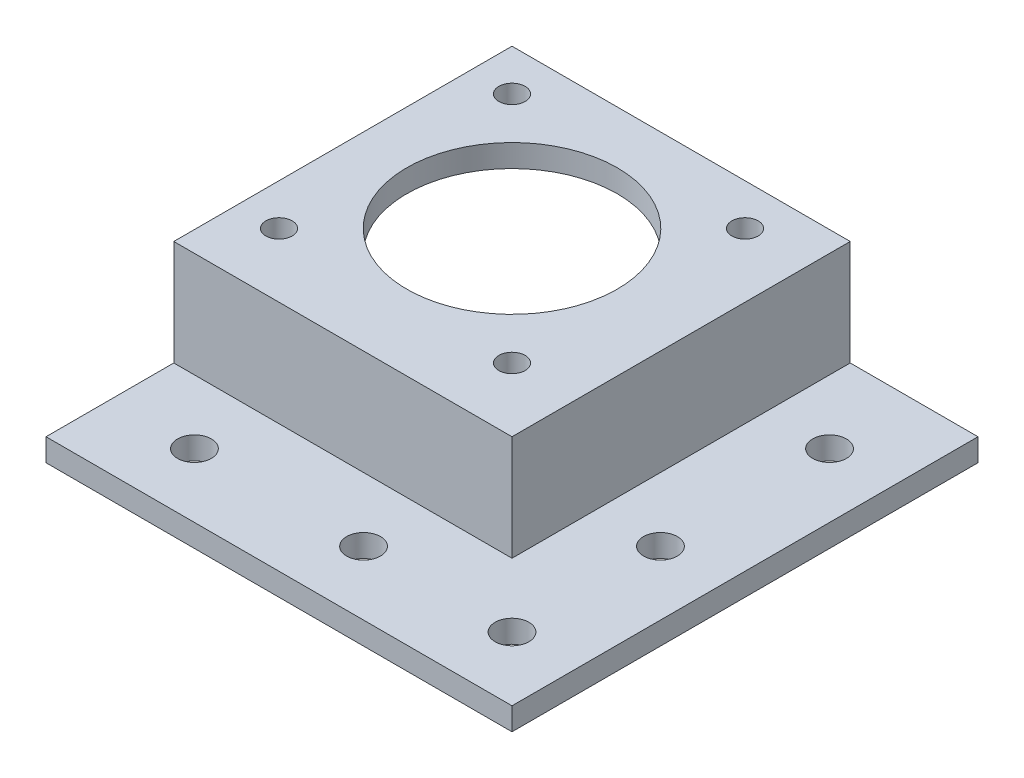
ISO-10303-21;
HEADER;
FILE_DESCRIPTION(('STEP AP214'),'2;1');
FILE_NAME('part.step','',(''),(''),'','','');
FILE_SCHEMA(('AUTOMOTIVE_DESIGN { 1 0 10303 214 1 1 1 1 }'));
ENDSEC;
DATA;
#1=APPLICATION_CONTEXT('core data for automotive mechanical design processes');
#2=APPLICATION_PROTOCOL_DEFINITION('international standard','automotive_design',2000,#1);
#3=PRODUCT_CONTEXT('',#1,'mechanical');
#4=PRODUCT('Part','Part','',(#3));
#5=PRODUCT_RELATED_PRODUCT_CATEGORY('part','',(#4));
#6=PRODUCT_DEFINITION_FORMATION('','',#4);
#7=PRODUCT_DEFINITION_CONTEXT('part definition',#1,'design');
#8=PRODUCT_DEFINITION('design','',#6,#7);
#9=PRODUCT_DEFINITION_SHAPE('','',#8);
#10=(LENGTH_UNIT() NAMED_UNIT(*) SI_UNIT(.MILLI.,.METRE.));
#11=(NAMED_UNIT(*) PLANE_ANGLE_UNIT() SI_UNIT($,.RADIAN.));
#12=(NAMED_UNIT(*) SI_UNIT($,.STERADIAN.) SOLID_ANGLE_UNIT());
#13=UNCERTAINTY_MEASURE_WITH_UNIT(LENGTH_MEASURE(1.E-05),#10,'distance_accuracy_value','');
#14=(GEOMETRIC_REPRESENTATION_CONTEXT(3) GLOBAL_UNCERTAINTY_ASSIGNED_CONTEXT((#13)) GLOBAL_UNIT_ASSIGNED_CONTEXT((#10,
#11,#12)) REPRESENTATION_CONTEXT('',''));
#15=CARTESIAN_POINT('',(0.,0.,0.));
#16=DIRECTION('',(0.,0.,1.));
#17=DIRECTION('',(1.,0.,0.));
#18=AXIS2_PLACEMENT_3D('',#15,#16,#17);
#19=CARTESIAN_POINT('',(0.,0.,42.));
#20=DIRECTION('',(0.,-1.,0.));
#21=DIRECTION('',(0.,0.,-1.));
#22=AXIS2_PLACEMENT_3D('',#19,#20,#21);
#23=PLANE('',#22);
#24=CARTESIAN_POINT('',(36.5,0.,36.5));
#25=DIRECTION('',(0.,-1.,0.));
#26=DIRECTION('',(0.,0.,1.));
#27=AXIS2_PLACEMENT_3D('',#24,#25,#26);
#28=CIRCLE('',#27,1.75);
#29=CARTESIAN_POINT('',(36.5,0.,38.25));
#30=VERTEX_POINT('',#29);
#31=EDGE_CURVE('E211',#30,#30,#28,.T.);
#32=ORIENTED_EDGE('',*,*,#31,.T.);
#33=EDGE_LOOP('',(#32));
#34=FACE_BOUND('',#33,.T.);
#35=CARTESIAN_POINT('',(36.5,0.,5.5));
#36=DIRECTION('',(0.,-1.,0.));
#37=DIRECTION('',(0.,0.,-1.));
#38=AXIS2_PLACEMENT_3D('',#35,#36,#37);
#39=CIRCLE('',#38,1.75);
#40=CARTESIAN_POINT('',(36.5,0.,3.75));
#41=VERTEX_POINT('',#40);
#42=EDGE_CURVE('E215',#41,#41,#39,.T.);
#43=ORIENTED_EDGE('',*,*,#42,.T.);
#44=EDGE_LOOP('',(#43));
#45=FACE_BOUND('',#44,.T.);
#46=CARTESIAN_POINT('',(21.,0.,21.));
#47=DIRECTION('',(0.,-1.,0.));
#48=DIRECTION('',(0.,0.,-1.));
#49=AXIS2_PLACEMENT_3D('',#46,#47,#48);
#50=CIRCLE('',#49,14.);
#51=CARTESIAN_POINT('',(21.,0.,7.));
#52=VERTEX_POINT('',#51);
#53=EDGE_CURVE('E219',#52,#52,#50,.T.);
#54=ORIENTED_EDGE('',*,*,#53,.T.);
#55=EDGE_LOOP('',(#54));
#56=FACE_BOUND('',#55,.T.);
#57=CARTESIAN_POINT('',(5.5,0.,5.5));
#58=DIRECTION('',(0.,-1.,0.));
#59=DIRECTION('',(0.,0.,1.));
#60=AXIS2_PLACEMENT_3D('',#57,#58,#59);
#61=CIRCLE('',#60,1.75);
#62=CARTESIAN_POINT('',(5.5,0.,7.25));
#63=VERTEX_POINT('',#62);
#64=EDGE_CURVE('E223',#63,#63,#61,.T.);
#65=ORIENTED_EDGE('',*,*,#64,.T.);
#66=EDGE_LOOP('',(#65));
#67=FACE_BOUND('',#66,.T.);
#68=CARTESIAN_POINT('',(5.5,0.,36.5));
#69=DIRECTION('',(0.,-1.,0.));
#70=DIRECTION('',(0.,0.,-1.));
#71=AXIS2_PLACEMENT_3D('',#68,#69,#70);
#72=CIRCLE('',#71,1.75);
#73=CARTESIAN_POINT('',(5.5,0.,34.75));
#74=VERTEX_POINT('',#73);
#75=EDGE_CURVE('E226',#74,#74,#72,.T.);
#76=ORIENTED_EDGE('',*,*,#75,.T.);
#77=EDGE_LOOP('',(#76));
#78=FACE_BOUND('',#77,.T.);
#79=DIRECTION('',(-1.,0.,0.));
#80=VECTOR('',#79,1.);
#81=CARTESIAN_POINT('',(0.,0.,0.));
#82=LINE('',#81,#80);
#83=CARTESIAN_POINT('',(45.,0.,0.));
#84=VERTEX_POINT('',#83);
#85=CARTESIAN_POINT('',(0.,0.,0.));
#86=VERTEX_POINT('',#85);
#87=EDGE_CURVE('E106',#84,#86,#82,.T.);
#88=ORIENTED_EDGE('',*,*,#87,.T.);
#89=DIRECTION('',(0.,0.,-1.));
#90=VECTOR('',#89,1.);
#91=CARTESIAN_POINT('',(0.,0.,42.));
#92=LINE('',#91,#90);
#93=CARTESIAN_POINT('',(0.,0.,45.));
#94=VERTEX_POINT('',#93);
#95=EDGE_CURVE('E41',#94,#86,#92,.T.);
#96=ORIENTED_EDGE('',*,*,#95,.F.);
#97=DIRECTION('',(-1.,0.,0.));
#98=VECTOR('',#97,1.);
#99=CARTESIAN_POINT('',(0.,0.,45.));
#100=LINE('',#99,#98);
#101=CARTESIAN_POINT('',(45.,0.,45.));
#102=VERTEX_POINT('',#101);
#103=EDGE_CURVE('E108',#102,#94,#100,.T.);
#104=ORIENTED_EDGE('',*,*,#103,.F.);
#105=DIRECTION('',(0.,0.,-1.));
#106=VECTOR('',#105,1.);
#107=CARTESIAN_POINT('',(45.,0.,42.));
#108=LINE('',#107,#106);
#109=EDGE_CURVE('E95',#102,#84,#108,.T.);
#110=ORIENTED_EDGE('',*,*,#109,.T.);
#111=EDGE_LOOP('',(#88,#96,#104,#110));
#112=FACE_BOUND('',#111,.T.);
#113=ADVANCED_FACE('F38',(#34,#45,#56,#67,#78,#112),#23,.F.);
#114=CARTESIAN_POINT('',(0.,0.,42.));
#115=DIRECTION('',(1.,0.,0.));
#116=DIRECTION('',(0.,0.,-1.));
#117=AXIS2_PLACEMENT_3D('',#114,#115,#116);
#118=PLANE('',#117);
#119=DIRECTION('',(0.,-1.,0.));
#120=VECTOR('',#119,1.);
#121=CARTESIAN_POINT('',(0.,0.,0.));
#122=LINE('',#121,#120);
#123=CARTESIAN_POINT('',(0.,-3.,0.));
#124=VERTEX_POINT('',#123);
#125=EDGE_CURVE('E113',#86,#124,#122,.T.);
#126=ORIENTED_EDGE('',*,*,#125,.T.);
#127=DIRECTION('',(0.,0.,-1.));
#128=VECTOR('',#127,1.);
#129=CARTESIAN_POINT('',(0.,-3.,42.));
#130=LINE('',#129,#128);
#131=CARTESIAN_POINT('',(0.,-3.,42.));
#132=VERTEX_POINT('',#131);
#133=EDGE_CURVE('E142',#132,#124,#130,.T.);
#134=ORIENTED_EDGE('',*,*,#133,.F.);
#135=DIRECTION('',(0.,1.,0.));
#136=VECTOR('',#135,1.);
#137=CARTESIAN_POINT('',(0.,0.,42.));
#138=LINE('',#137,#136);
#139=CARTESIAN_POINT('',(0.,-17.,42.));
#140=VERTEX_POINT('',#139);
#141=EDGE_CURVE('E158',#140,#132,#138,.T.);
#142=ORIENTED_EDGE('',*,*,#141,.F.);
#143=DIRECTION('',(0.,0.,-1.));
#144=VECTOR('',#143,1.);
#145=CARTESIAN_POINT('',(0.,-17.,45.));
#146=LINE('',#145,#144);
#147=CARTESIAN_POINT('',(0.,-17.,62.));
#148=VERTEX_POINT('',#147);
#149=EDGE_CURVE('E115',#148,#140,#146,.T.);
#150=ORIENTED_EDGE('',*,*,#149,.F.);
#151=DIRECTION('',(0.,-1.,0.));
#152=VECTOR('',#151,1.);
#153=CARTESIAN_POINT('',(0.,-17.,62.));
#154=LINE('',#153,#152);
#155=CARTESIAN_POINT('',(0.,-14.,62.));
#156=VERTEX_POINT('',#155);
#157=EDGE_CURVE('E228',#156,#148,#154,.T.);
#158=ORIENTED_EDGE('',*,*,#157,.F.);
#159=DIRECTION('',(0.,0.,-1.));
#160=VECTOR('',#159,1.);
#161=CARTESIAN_POINT('',(0.,-14.,62.));
#162=LINE('',#161,#160);
#163=CARTESIAN_POINT('',(0.,-14.,45.));
#164=VERTEX_POINT('',#163);
#165=EDGE_CURVE('E165',#156,#164,#162,.T.);
#166=ORIENTED_EDGE('',*,*,#165,.T.);
#167=DIRECTION('',(0.,1.,0.));
#168=VECTOR('',#167,1.);
#169=CARTESIAN_POINT('',(0.,0.,45.));
#170=LINE('',#169,#168);
#171=EDGE_CURVE('E120',#164,#94,#170,.T.);
#172=ORIENTED_EDGE('',*,*,#171,.T.);
#173=ORIENTED_EDGE('',*,*,#95,.T.);
#174=EDGE_LOOP('',(#126,#134,#142,#150,#158,#166,#172,#173));
#175=FACE_BOUND('',#174,.T.);
#176=ADVANCED_FACE('F146',(#175),#118,.F.);
#177=CARTESIAN_POINT('',(0.,-3.,42.));
#178=DIRECTION('',(0.,1.,0.));
#179=DIRECTION('',(0.,0.,1.));
#180=AXIS2_PLACEMENT_3D('',#177,#178,#179);
#181=PLANE('',#180);
#182=CARTESIAN_POINT('',(36.5,-3.,36.5));
#183=DIRECTION('',(0.,-1.,0.));
#184=DIRECTION('',(0.,0.,1.));
#185=AXIS2_PLACEMENT_3D('',#182,#183,#184);
#186=CIRCLE('',#185,1.75);
#187=CARTESIAN_POINT('',(36.5,-3.,38.25));
#188=VERTEX_POINT('',#187);
#189=EDGE_CURVE('E233',#188,#188,#186,.T.);
#190=ORIENTED_EDGE('',*,*,#189,.F.);
#191=EDGE_LOOP('',(#190));
#192=FACE_BOUND('',#191,.T.);
#193=CARTESIAN_POINT('',(36.5,-3.,5.5));
#194=DIRECTION('',(0.,-1.,0.));
#195=DIRECTION('',(0.,0.,-1.));
#196=AXIS2_PLACEMENT_3D('',#193,#194,#195);
#197=CIRCLE('',#196,1.75);
#198=CARTESIAN_POINT('',(36.5,-3.,3.75));
#199=VERTEX_POINT('',#198);
#200=EDGE_CURVE('E371',#199,#199,#197,.T.);
#201=ORIENTED_EDGE('',*,*,#200,.F.);
#202=EDGE_LOOP('',(#201));
#203=FACE_BOUND('',#202,.T.);
#204=CARTESIAN_POINT('',(21.,-3.,21.));
#205=DIRECTION('',(0.,-1.,0.));
#206=DIRECTION('',(0.,0.,-1.));
#207=AXIS2_PLACEMENT_3D('',#204,#205,#206);
#208=CIRCLE('',#207,14.);
#209=CARTESIAN_POINT('',(21.,-3.,7.));
#210=VERTEX_POINT('',#209);
#211=EDGE_CURVE('E361',#210,#210,#208,.T.);
#212=ORIENTED_EDGE('',*,*,#211,.F.);
#213=EDGE_LOOP('',(#212));
#214=FACE_BOUND('',#213,.T.);
#215=CARTESIAN_POINT('',(5.5,-3.,5.5));
#216=DIRECTION('',(0.,-1.,0.));
#217=DIRECTION('',(0.,0.,1.));
#218=AXIS2_PLACEMENT_3D('',#215,#216,#217);
#219=CIRCLE('',#218,1.75);
#220=CARTESIAN_POINT('',(5.5,-3.,7.25));
#221=VERTEX_POINT('',#220);
#222=EDGE_CURVE('E365',#221,#221,#219,.T.);
#223=ORIENTED_EDGE('',*,*,#222,.F.);
#224=EDGE_LOOP('',(#223));
#225=FACE_BOUND('',#224,.T.);
#226=CARTESIAN_POINT('',(5.5,-3.,36.5));
#227=DIRECTION('',(0.,-1.,0.));
#228=DIRECTION('',(0.,0.,-1.));
#229=AXIS2_PLACEMENT_3D('',#226,#227,#228);
#230=CIRCLE('',#229,1.75);
#231=CARTESIAN_POINT('',(5.5,-3.,34.75));
#232=VERTEX_POINT('',#231);
#233=EDGE_CURVE('E229',#232,#232,#230,.T.);
#234=ORIENTED_EDGE('',*,*,#233,.F.);
#235=EDGE_LOOP('',(#234));
#236=FACE_BOUND('',#235,.T.);
#237=DIRECTION('',(1.,0.,0.));
#238=VECTOR('',#237,1.);
#239=CARTESIAN_POINT('',(0.,-3.,0.));
#240=LINE('',#239,#238);
#241=CARTESIAN_POINT('',(42.,-3.,0.));
#242=VERTEX_POINT('',#241);
#243=EDGE_CURVE('E117',#124,#242,#240,.T.);
#244=ORIENTED_EDGE('',*,*,#243,.T.);
#245=DIRECTION('',(0.,0.,-1.));
#246=VECTOR('',#245,1.);
#247=CARTESIAN_POINT('',(42.,-3.,42.));
#248=LINE('',#247,#246);
#249=CARTESIAN_POINT('',(42.,-3.,42.));
#250=VERTEX_POINT('',#249);
#251=EDGE_CURVE('E55',#250,#242,#248,.T.);
#252=ORIENTED_EDGE('',*,*,#251,.F.);
#253=DIRECTION('',(1.,0.,0.));
#254=VECTOR('',#253,1.);
#255=CARTESIAN_POINT('',(0.,-3.,42.));
#256=LINE('',#255,#254);
#257=EDGE_CURVE('E100',#132,#250,#256,.T.);
#258=ORIENTED_EDGE('',*,*,#257,.F.);
#259=ORIENTED_EDGE('',*,*,#133,.T.);
#260=EDGE_LOOP('',(#244,#252,#258,#259));
#261=FACE_BOUND('',#260,.T.);
#262=ADVANCED_FACE('F190',(#192,#203,#214,#225,#236,#261),#181,.F.);
#263=CARTESIAN_POINT('',(42.,-3.,42.));
#264=DIRECTION('',(1.,0.,0.));
#265=DIRECTION('',(0.,0.,-1.));
#266=AXIS2_PLACEMENT_3D('',#263,#264,#265);
#267=PLANE('',#266);
#268=DIRECTION('',(0.,-1.,0.));
#269=VECTOR('',#268,1.);
#270=CARTESIAN_POINT('',(42.,-3.,0.));
#271=LINE('',#270,#269);
#272=CARTESIAN_POINT('',(42.,-17.,0.));
#273=VERTEX_POINT('',#272);
#274=EDGE_CURVE('E126',#242,#273,#271,.T.);
#275=ORIENTED_EDGE('',*,*,#274,.T.);
#276=DIRECTION('',(0.,0.,-1.));
#277=VECTOR('',#276,1.);
#278=CARTESIAN_POINT('',(42.,-17.,42.));
#279=LINE('',#278,#277);
#280=CARTESIAN_POINT('',(42.,-17.,42.));
#281=VERTEX_POINT('',#280);
#282=EDGE_CURVE('E139',#281,#273,#279,.T.);
#283=ORIENTED_EDGE('',*,*,#282,.F.);
#284=DIRECTION('',(0.,-1.,0.));
#285=VECTOR('',#284,1.);
#286=CARTESIAN_POINT('',(42.,-3.,42.));
#287=LINE('',#286,#285);
#288=EDGE_CURVE('E109',#250,#281,#287,.T.);
#289=ORIENTED_EDGE('',*,*,#288,.F.);
#290=ORIENTED_EDGE('',*,*,#251,.T.);
#291=EDGE_LOOP('',(#275,#283,#289,#290));
#292=FACE_BOUND('',#291,.T.);
#293=ADVANCED_FACE('F192',(#292),#267,.F.);
#294=CARTESIAN_POINT('',(42.,-17.,42.));
#295=DIRECTION('',(0.,1.,0.));
#296=DIRECTION('',(0.,0.,1.));
#297=AXIS2_PLACEMENT_3D('',#294,#295,#296);
#298=PLANE('',#297);
#299=CARTESIAN_POINT('',(11.25,-17.,53.5));
#300=DIRECTION('',(0.,1.,0.));
#301=DIRECTION('',(0.,0.,1.));
#302=AXIS2_PLACEMENT_3D('',#299,#300,#301);
#303=CIRCLE('',#302,2.25);
#304=CARTESIAN_POINT('',(11.25,-17.,55.75));
#305=VERTEX_POINT('',#304);
#306=EDGE_CURVE('E330',#305,#305,#303,.T.);
#307=ORIENTED_EDGE('',*,*,#306,.T.);
#308=EDGE_LOOP('',(#307));
#309=FACE_BOUND('',#308,.T.);
#310=CARTESIAN_POINT('',(53.5,-17.,53.5));
#311=DIRECTION('',(0.,1.,0.));
#312=DIRECTION('',(0.,0.,1.));
#313=AXIS2_PLACEMENT_3D('',#310,#311,#312);
#314=CIRCLE('',#313,2.25);
#315=CARTESIAN_POINT('',(53.5,-17.,55.75));
#316=VERTEX_POINT('',#315);
#317=EDGE_CURVE('E338',#316,#316,#314,.T.);
#318=ORIENTED_EDGE('',*,*,#317,.T.);
#319=EDGE_LOOP('',(#318));
#320=FACE_BOUND('',#319,.T.);
#321=CARTESIAN_POINT('',(33.75,-17.,53.5));
#322=DIRECTION('',(0.,1.,0.));
#323=DIRECTION('',(0.,0.,-1.));
#324=AXIS2_PLACEMENT_3D('',#321,#322,#323);
#325=CIRCLE('',#324,2.25);
#326=CARTESIAN_POINT('',(33.75,-17.,51.25));
#327=VERTEX_POINT('',#326);
#328=EDGE_CURVE('E346',#327,#327,#325,.T.);
#329=ORIENTED_EDGE('',*,*,#328,.T.);
#330=EDGE_LOOP('',(#329));
#331=FACE_BOUND('',#330,.T.);
#332=CARTESIAN_POINT('',(53.5,-17.,11.25));
#333=DIRECTION('',(0.,1.,0.));
#334=DIRECTION('',(0.,0.,-1.));
#335=AXIS2_PLACEMENT_3D('',#332,#333,#334);
#336=CIRCLE('',#335,2.25000000000001);
#337=CARTESIAN_POINT('',(53.5,-17.,9.));
#338=VERTEX_POINT('',#337);
#339=EDGE_CURVE('E352',#338,#338,#336,.T.);
#340=ORIENTED_EDGE('',*,*,#339,.T.);
#341=EDGE_LOOP('',(#340));
#342=FACE_BOUND('',#341,.T.);
#343=CARTESIAN_POINT('',(53.5,-17.,33.75));
#344=DIRECTION('',(0.,1.,0.));
#345=DIRECTION('',(0.,0.,1.));
#346=AXIS2_PLACEMENT_3D('',#343,#344,#345);
#347=CIRCLE('',#346,2.25);
#348=CARTESIAN_POINT('',(53.5,-17.,36.));
#349=VERTEX_POINT('',#348);
#350=EDGE_CURVE('E358',#349,#349,#347,.T.);
#351=ORIENTED_EDGE('',*,*,#350,.T.);
#352=EDGE_LOOP('',(#351));
#353=FACE_BOUND('',#352,.T.);
#354=DIRECTION('',(1.,0.,0.));
#355=VECTOR('',#354,1.);
#356=CARTESIAN_POINT('',(42.,-17.,0.));
#357=LINE('',#356,#355);
#358=CARTESIAN_POINT('',(62.,-17.,0.));
#359=VERTEX_POINT('',#358);
#360=EDGE_CURVE('E128',#273,#359,#357,.T.);
#361=ORIENTED_EDGE('',*,*,#360,.T.);
#362=DIRECTION('',(0.,0.,-1.));
#363=VECTOR('',#362,1.);
#364=CARTESIAN_POINT('',(62.,-17.,42.));
#365=LINE('',#364,#363);
#366=CARTESIAN_POINT('',(62.,-17.,62.));
#367=VERTEX_POINT('',#366);
#368=EDGE_CURVE('E136',#367,#359,#365,.T.);
#369=ORIENTED_EDGE('',*,*,#368,.F.);
#370=DIRECTION('',(1.,0.,0.));
#371=VECTOR('',#370,1.);
#372=CARTESIAN_POINT('',(0.,-17.,62.));
#373=LINE('',#372,#371);
#374=EDGE_CURVE('E184',#148,#367,#373,.T.);
#375=ORIENTED_EDGE('',*,*,#374,.F.);
#376=ORIENTED_EDGE('',*,*,#149,.T.);
#377=DIRECTION('',(-1.,0.,0.));
#378=VECTOR('',#377,1.);
#379=CARTESIAN_POINT('',(0.,-17.,42.));
#380=LINE('',#379,#378);
#381=EDGE_CURVE('E162',#281,#140,#380,.T.);
#382=ORIENTED_EDGE('',*,*,#381,.F.);
#383=ORIENTED_EDGE('',*,*,#282,.T.);
#384=EDGE_LOOP('',(#361,#369,#375,#376,#382,#383));
#385=FACE_BOUND('',#384,.T.);
#386=ADVANCED_FACE('F176',(#309,#320,#331,#342,#353,#385),#298,.F.);
#387=CARTESIAN_POINT('',(62.,-17.,42.));
#388=DIRECTION('',(-1.,0.,0.));
#389=DIRECTION('',(0.,0.,1.));
#390=AXIS2_PLACEMENT_3D('',#387,#388,#389);
#391=PLANE('',#390);
#392=DIRECTION('',(0.,1.,0.));
#393=VECTOR('',#392,1.);
#394=CARTESIAN_POINT('',(62.,-17.,0.));
#395=LINE('',#394,#393);
#396=CARTESIAN_POINT('',(62.,-14.,0.));
#397=VERTEX_POINT('',#396);
#398=EDGE_CURVE('E130',#359,#397,#395,.T.);
#399=ORIENTED_EDGE('',*,*,#398,.T.);
#400=DIRECTION('',(0.,0.,-1.));
#401=VECTOR('',#400,1.);
#402=CARTESIAN_POINT('',(62.,-14.,42.));
#403=LINE('',#402,#401);
#404=CARTESIAN_POINT('',(62.,-14.,62.));
#405=VERTEX_POINT('',#404);
#406=EDGE_CURVE('E134',#405,#397,#403,.T.);
#407=ORIENTED_EDGE('',*,*,#406,.F.);
#408=DIRECTION('',(0.,1.,0.));
#409=VECTOR('',#408,1.);
#410=CARTESIAN_POINT('',(62.,-17.,62.));
#411=LINE('',#410,#409);
#412=EDGE_CURVE('E239',#367,#405,#411,.T.);
#413=ORIENTED_EDGE('',*,*,#412,.F.);
#414=ORIENTED_EDGE('',*,*,#368,.T.);
#415=EDGE_LOOP('',(#399,#407,#413,#414));
#416=FACE_BOUND('',#415,.T.);
#417=ADVANCED_FACE('F262',(#416),#391,.F.);
#418=CARTESIAN_POINT('',(45.,-14.,42.));
#419=DIRECTION('',(0.,-1.,0.));
#420=DIRECTION('',(0.,0.,-1.));
#421=AXIS2_PLACEMENT_3D('',#418,#419,#420);
#422=PLANE('',#421);
#423=CARTESIAN_POINT('',(11.25,-14.,53.5));
#424=DIRECTION('',(0.,1.,0.));
#425=DIRECTION('',(0.,0.,1.));
#426=AXIS2_PLACEMENT_3D('',#423,#424,#425);
#427=CIRCLE('',#426,2.25);
#428=CARTESIAN_POINT('',(11.25,-14.,55.75));
#429=VERTEX_POINT('',#428);
#430=EDGE_CURVE('E333',#429,#429,#427,.T.);
#431=ORIENTED_EDGE('',*,*,#430,.F.);
#432=EDGE_LOOP('',(#431));
#433=FACE_BOUND('',#432,.T.);
#434=CARTESIAN_POINT('',(53.5,-14.,53.5));
#435=DIRECTION('',(0.,1.,0.));
#436=DIRECTION('',(0.,0.,1.));
#437=AXIS2_PLACEMENT_3D('',#434,#435,#436);
#438=CIRCLE('',#437,2.25);
#439=CARTESIAN_POINT('',(53.5,-14.,55.75));
#440=VERTEX_POINT('',#439);
#441=EDGE_CURVE('E334',#440,#440,#438,.T.);
#442=ORIENTED_EDGE('',*,*,#441,.F.);
#443=EDGE_LOOP('',(#442));
#444=FACE_BOUND('',#443,.T.);
#445=CARTESIAN_POINT('',(33.75,-14.,53.5));
#446=DIRECTION('',(0.,1.,0.));
#447=DIRECTION('',(0.,0.,-1.));
#448=AXIS2_PLACEMENT_3D('',#445,#446,#447);
#449=CIRCLE('',#448,2.25);
#450=CARTESIAN_POINT('',(33.75,-14.,51.25));
#451=VERTEX_POINT('',#450);
#452=EDGE_CURVE('E343',#451,#451,#449,.T.);
#453=ORIENTED_EDGE('',*,*,#452,.F.);
#454=EDGE_LOOP('',(#453));
#455=FACE_BOUND('',#454,.T.);
#456=CARTESIAN_POINT('',(53.5,-14.,11.25));
#457=DIRECTION('',(0.,1.,0.));
#458=DIRECTION('',(0.,0.,-1.));
#459=AXIS2_PLACEMENT_3D('',#456,#457,#458);
#460=CIRCLE('',#459,2.25000000000001);
#461=CARTESIAN_POINT('',(53.5,-14.,9.));
#462=VERTEX_POINT('',#461);
#463=EDGE_CURVE('E349',#462,#462,#460,.T.);
#464=ORIENTED_EDGE('',*,*,#463,.F.);
#465=EDGE_LOOP('',(#464));
#466=FACE_BOUND('',#465,.T.);
#467=CARTESIAN_POINT('',(53.5,-14.,33.75));
#468=DIRECTION('',(0.,1.,0.));
#469=DIRECTION('',(0.,0.,1.));
#470=AXIS2_PLACEMENT_3D('',#467,#468,#469);
#471=CIRCLE('',#470,2.25);
#472=CARTESIAN_POINT('',(53.5,-14.,36.));
#473=VERTEX_POINT('',#472);
#474=EDGE_CURVE('E355',#473,#473,#471,.T.);
#475=ORIENTED_EDGE('',*,*,#474,.F.);
#476=EDGE_LOOP('',(#475));
#477=FACE_BOUND('',#476,.T.);
#478=DIRECTION('',(-1.,0.,0.));
#479=VECTOR('',#478,1.);
#480=CARTESIAN_POINT('',(45.,-14.,0.));
#481=LINE('',#480,#479);
#482=CARTESIAN_POINT('',(45.,-14.,0.));
#483=VERTEX_POINT('',#482);
#484=EDGE_CURVE('E84',#397,#483,#481,.T.);
#485=ORIENTED_EDGE('',*,*,#484,.T.);
#486=DIRECTION('',(0.,0.,-1.));
#487=VECTOR('',#486,1.);
#488=CARTESIAN_POINT('',(45.,-14.,42.));
#489=LINE('',#488,#487);
#490=CARTESIAN_POINT('',(45.,-14.,45.));
#491=VERTEX_POINT('',#490);
#492=EDGE_CURVE('E97',#491,#483,#489,.T.);
#493=ORIENTED_EDGE('',*,*,#492,.F.);
#494=DIRECTION('',(-1.,0.,0.));
#495=VECTOR('',#494,1.);
#496=CARTESIAN_POINT('',(0.,-14.,45.));
#497=LINE('',#496,#495);
#498=EDGE_CURVE('E11',#491,#164,#497,.T.);
#499=ORIENTED_EDGE('',*,*,#498,.T.);
#500=ORIENTED_EDGE('',*,*,#165,.F.);
#501=DIRECTION('',(-1.,0.,0.));
#502=VECTOR('',#501,1.);
#503=CARTESIAN_POINT('',(0.,-14.,62.));
#504=LINE('',#503,#502);
#505=EDGE_CURVE('E242',#405,#156,#504,.T.);
#506=ORIENTED_EDGE('',*,*,#505,.F.);
#507=ORIENTED_EDGE('',*,*,#406,.T.);
#508=EDGE_LOOP('',(#485,#493,#499,#500,#506,#507));
#509=FACE_BOUND('',#508,.T.);
#510=ADVANCED_FACE('F247',(#433,#444,#455,#466,#477,#509),#422,.F.);
#511=CARTESIAN_POINT('',(45.,0.,42.));
#512=DIRECTION('',(-1.,0.,0.));
#513=DIRECTION('',(0.,-1.,0.));
#514=AXIS2_PLACEMENT_3D('',#511,#512,#513);
#515=PLANE('',#514);
#516=DIRECTION('',(0.,1.,0.));
#517=VECTOR('',#516,1.);
#518=CARTESIAN_POINT('',(45.,0.,0.));
#519=LINE('',#518,#517);
#520=EDGE_CURVE('E90',#483,#84,#519,.T.);
#521=ORIENTED_EDGE('',*,*,#520,.T.);
#522=ORIENTED_EDGE('',*,*,#109,.F.);
#523=DIRECTION('',(0.,1.,0.));
#524=VECTOR('',#523,1.);
#525=CARTESIAN_POINT('',(45.,0.,45.));
#526=LINE('',#525,#524);
#527=EDGE_CURVE('E155',#491,#102,#526,.T.);
#528=ORIENTED_EDGE('',*,*,#527,.F.);
#529=ORIENTED_EDGE('',*,*,#492,.T.);
#530=EDGE_LOOP('',(#521,#522,#528,#529));
#531=FACE_BOUND('',#530,.T.);
#532=ADVANCED_FACE('F92',(#531),#515,.F.);
#533=CARTESIAN_POINT('',(0.,0.,0.));
#534=DIRECTION('',(0.,0.,-1.));
#535=DIRECTION('',(-1.,0.,0.));
#536=AXIS2_PLACEMENT_3D('',#533,#534,#535);
#537=PLANE('',#536);
#538=ORIENTED_EDGE('',*,*,#87,.F.);
#539=ORIENTED_EDGE('',*,*,#520,.F.);
#540=ORIENTED_EDGE('',*,*,#484,.F.);
#541=ORIENTED_EDGE('',*,*,#398,.F.);
#542=ORIENTED_EDGE('',*,*,#360,.F.);
#543=ORIENTED_EDGE('',*,*,#274,.F.);
#544=ORIENTED_EDGE('',*,*,#243,.F.);
#545=ORIENTED_EDGE('',*,*,#125,.F.);
#546=EDGE_LOOP('',(#538,#539,#540,#541,#542,#543,#544,#545));
#547=FACE_BOUND('',#546,.T.);
#548=ADVANCED_FACE('F111',(#547),#537,.T.);
#549=CARTESIAN_POINT('',(0.,0.,42.));
#550=DIRECTION('',(0.,0.,1.));
#551=DIRECTION('',(1.,0.,0.));
#552=AXIS2_PLACEMENT_3D('',#549,#550,#551);
#553=PLANE('',#552);
#554=ORIENTED_EDGE('',*,*,#141,.T.);
#555=ORIENTED_EDGE('',*,*,#257,.T.);
#556=ORIENTED_EDGE('',*,*,#288,.T.);
#557=ORIENTED_EDGE('',*,*,#381,.T.);
#558=EDGE_LOOP('',(#554,#555,#556,#557));
#559=FACE_BOUND('',#558,.T.);
#560=ADVANCED_FACE('F171',(#559),#553,.F.);
#561=CARTESIAN_POINT('',(0.,0.,45.));
#562=DIRECTION('',(0.,0.,1.));
#563=DIRECTION('',(1.,0.,0.));
#564=AXIS2_PLACEMENT_3D('',#561,#562,#563);
#565=PLANE('',#564);
#566=ORIENTED_EDGE('',*,*,#498,.F.);
#567=ORIENTED_EDGE('',*,*,#527,.T.);
#568=ORIENTED_EDGE('',*,*,#103,.T.);
#569=ORIENTED_EDGE('',*,*,#171,.F.);
#570=EDGE_LOOP('',(#566,#567,#568,#569));
#571=FACE_BOUND('',#570,.T.);
#572=ADVANCED_FACE('F153',(#571),#565,.T.);
#573=CARTESIAN_POINT('',(0.,0.,62.));
#574=DIRECTION('',(0.,0.,-1.));
#575=DIRECTION('',(-1.,0.,0.));
#576=AXIS2_PLACEMENT_3D('',#573,#574,#575);
#577=PLANE('',#576);
#578=ORIENTED_EDGE('',*,*,#157,.T.);
#579=ORIENTED_EDGE('',*,*,#374,.T.);
#580=ORIENTED_EDGE('',*,*,#412,.T.);
#581=ORIENTED_EDGE('',*,*,#505,.T.);
#582=EDGE_LOOP('',(#578,#579,#580,#581));
#583=FACE_BOUND('',#582,.T.);
#584=ADVANCED_FACE('F261',(#583),#577,.F.);
#585=CARTESIAN_POINT('',(5.5,0.,36.5));
#586=DIRECTION('',(0.,-1.,0.));
#587=DIRECTION('',(0.,0.,-1.));
#588=AXIS2_PLACEMENT_3D('',#585,#586,#587);
#589=CYLINDRICAL_SURFACE('',#588,1.75);
#590=ORIENTED_EDGE('',*,*,#75,.F.);
#591=EDGE_LOOP('',(#590));
#592=FACE_BOUND('',#591,.T.);
#593=ORIENTED_EDGE('',*,*,#233,.T.);
#594=EDGE_LOOP('',(#593));
#595=FACE_BOUND('',#594,.T.);
#596=ADVANCED_FACE('F287',(#592,#595),#589,.F.);
#597=CARTESIAN_POINT('',(5.5,0.,5.5));
#598=DIRECTION('',(0.,-1.,0.));
#599=DIRECTION('',(0.,0.,-1.));
#600=AXIS2_PLACEMENT_3D('',#597,#598,#599);
#601=CYLINDRICAL_SURFACE('',#600,1.75);
#602=ORIENTED_EDGE('',*,*,#64,.F.);
#603=EDGE_LOOP('',(#602));
#604=FACE_BOUND('',#603,.T.);
#605=ORIENTED_EDGE('',*,*,#222,.T.);
#606=EDGE_LOOP('',(#605));
#607=FACE_BOUND('',#606,.T.);
#608=ADVANCED_FACE('F290',(#604,#607),#601,.F.);
#609=CARTESIAN_POINT('',(21.,0.,21.));
#610=DIRECTION('',(0.,-1.,0.));
#611=DIRECTION('',(0.,0.,-1.));
#612=AXIS2_PLACEMENT_3D('',#609,#610,#611);
#613=CYLINDRICAL_SURFACE('',#612,14.);
#614=ORIENTED_EDGE('',*,*,#53,.F.);
#615=EDGE_LOOP('',(#614));
#616=FACE_BOUND('',#615,.T.);
#617=ORIENTED_EDGE('',*,*,#211,.T.);
#618=EDGE_LOOP('',(#617));
#619=FACE_BOUND('',#618,.T.);
#620=ADVANCED_FACE('F295',(#616,#619),#613,.F.);
#621=CARTESIAN_POINT('',(36.5,0.,5.5));
#622=DIRECTION('',(0.,-1.,0.));
#623=DIRECTION('',(0.,0.,-1.));
#624=AXIS2_PLACEMENT_3D('',#621,#622,#623);
#625=CYLINDRICAL_SURFACE('',#624,1.75);
#626=ORIENTED_EDGE('',*,*,#42,.F.);
#627=EDGE_LOOP('',(#626));
#628=FACE_BOUND('',#627,.T.);
#629=ORIENTED_EDGE('',*,*,#200,.T.);
#630=EDGE_LOOP('',(#629));
#631=FACE_BOUND('',#630,.T.);
#632=ADVANCED_FACE('F291',(#628,#631),#625,.F.);
#633=CARTESIAN_POINT('',(36.5,0.,36.5));
#634=DIRECTION('',(0.,-1.,0.));
#635=DIRECTION('',(0.,0.,-1.));
#636=AXIS2_PLACEMENT_3D('',#633,#634,#635);
#637=CYLINDRICAL_SURFACE('',#636,1.75);
#638=ORIENTED_EDGE('',*,*,#31,.F.);
#639=EDGE_LOOP('',(#638));
#640=FACE_BOUND('',#639,.T.);
#641=ORIENTED_EDGE('',*,*,#189,.T.);
#642=EDGE_LOOP('',(#641));
#643=FACE_BOUND('',#642,.T.);
#644=ADVANCED_FACE('F294',(#640,#643),#637,.F.);
#645=CARTESIAN_POINT('',(53.5,-17.,33.75));
#646=DIRECTION('',(0.,1.,0.));
#647=DIRECTION('',(0.,0.,1.));
#648=AXIS2_PLACEMENT_3D('',#645,#646,#647);
#649=CYLINDRICAL_SURFACE('',#648,2.25);
#650=ORIENTED_EDGE('',*,*,#350,.F.);
#651=EDGE_LOOP('',(#650));
#652=FACE_BOUND('',#651,.T.);
#653=ORIENTED_EDGE('',*,*,#474,.T.);
#654=EDGE_LOOP('',(#653));
#655=FACE_BOUND('',#654,.T.);
#656=ADVANCED_FACE('F299',(#652,#655),#649,.F.);
#657=CARTESIAN_POINT('',(53.5,-17.,11.25));
#658=DIRECTION('',(0.,1.,0.));
#659=DIRECTION('',(0.,0.,1.));
#660=AXIS2_PLACEMENT_3D('',#657,#658,#659);
#661=CYLINDRICAL_SURFACE('',#660,2.25000000000001);
#662=ORIENTED_EDGE('',*,*,#339,.F.);
#663=EDGE_LOOP('',(#662));
#664=FACE_BOUND('',#663,.T.);
#665=ORIENTED_EDGE('',*,*,#463,.T.);
#666=EDGE_LOOP('',(#665));
#667=FACE_BOUND('',#666,.T.);
#668=ADVANCED_FACE('F309',(#664,#667),#661,.F.);
#669=CARTESIAN_POINT('',(33.75,-17.,53.5));
#670=DIRECTION('',(0.,1.,0.));
#671=DIRECTION('',(0.,0.,1.));
#672=AXIS2_PLACEMENT_3D('',#669,#670,#671);
#673=CYLINDRICAL_SURFACE('',#672,2.25);
#674=ORIENTED_EDGE('',*,*,#328,.F.);
#675=EDGE_LOOP('',(#674));
#676=FACE_BOUND('',#675,.T.);
#677=ORIENTED_EDGE('',*,*,#452,.T.);
#678=EDGE_LOOP('',(#677));
#679=FACE_BOUND('',#678,.T.);
#680=ADVANCED_FACE('F313',(#676,#679),#673,.F.);
#681=CARTESIAN_POINT('',(53.5,-17.,53.5));
#682=DIRECTION('',(0.,1.,0.));
#683=DIRECTION('',(0.,0.,1.));
#684=AXIS2_PLACEMENT_3D('',#681,#682,#683);
#685=CYLINDRICAL_SURFACE('',#684,2.25);
#686=ORIENTED_EDGE('',*,*,#317,.F.);
#687=EDGE_LOOP('',(#686));
#688=FACE_BOUND('',#687,.T.);
#689=ORIENTED_EDGE('',*,*,#441,.T.);
#690=EDGE_LOOP('',(#689));
#691=FACE_BOUND('',#690,.T.);
#692=ADVANCED_FACE('F317',(#688,#691),#685,.F.);
#693=CARTESIAN_POINT('',(11.25,-17.,53.5));
#694=DIRECTION('',(0.,1.,0.));
#695=DIRECTION('',(0.,0.,1.));
#696=AXIS2_PLACEMENT_3D('',#693,#694,#695);
#697=CYLINDRICAL_SURFACE('',#696,2.25);
#698=ORIENTED_EDGE('',*,*,#306,.F.);
#699=EDGE_LOOP('',(#698));
#700=FACE_BOUND('',#699,.T.);
#701=ORIENTED_EDGE('',*,*,#430,.T.);
#702=EDGE_LOOP('',(#701));
#703=FACE_BOUND('',#702,.T.);
#704=ADVANCED_FACE('F321',(#700,#703),#697,.F.);
#705=CLOSED_SHELL('',(#113,#176,#262,#293,#386,#417,#510,#532,#548,#560,#572,#584,#596,#608,
#620,#632,#644,#656,#668,#680,#692,#704));
#706=MANIFOLD_SOLID_BREP('B2',#705);
#707=ADVANCED_BREP_SHAPE_REPRESENTATION('',(#18,#706),#14);
#708=SHAPE_DEFINITION_REPRESENTATION(#9,#707);
ENDSEC;
END-ISO-10303-21;
